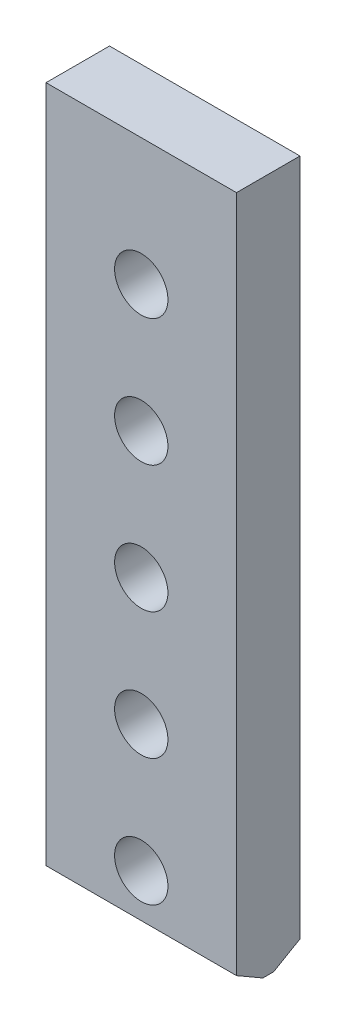
ISO-10303-21;
HEADER;
FILE_DESCRIPTION(('STEP AP214'),'2;1');
FILE_NAME('part.step','',(''),(''),'','','');
FILE_SCHEMA(('AUTOMOTIVE_DESIGN { 1 0 10303 214 1 1 1 1 }'));
ENDSEC;
DATA;
#1=APPLICATION_CONTEXT('core data for automotive mechanical design processes');
#2=APPLICATION_PROTOCOL_DEFINITION('international standard','automotive_design',2000,#1);
#3=PRODUCT_CONTEXT('',#1,'mechanical');
#4=PRODUCT('Part','Part','',(#3));
#5=PRODUCT_RELATED_PRODUCT_CATEGORY('part','',(#4));
#6=PRODUCT_DEFINITION_FORMATION('','',#4);
#7=PRODUCT_DEFINITION_CONTEXT('part definition',#1,'design');
#8=PRODUCT_DEFINITION('design','',#6,#7);
#9=PRODUCT_DEFINITION_SHAPE('','',#8);
#10=(LENGTH_UNIT() NAMED_UNIT(*) SI_UNIT(.MILLI.,.METRE.));
#11=(NAMED_UNIT(*) PLANE_ANGLE_UNIT() SI_UNIT($,.RADIAN.));
#12=(NAMED_UNIT(*) SI_UNIT($,.STERADIAN.) SOLID_ANGLE_UNIT());
#13=UNCERTAINTY_MEASURE_WITH_UNIT(LENGTH_MEASURE(1.E-05),#10,'distance_accuracy_value','');
#14=(GEOMETRIC_REPRESENTATION_CONTEXT(3) GLOBAL_UNCERTAINTY_ASSIGNED_CONTEXT((#13)) GLOBAL_UNIT_ASSIGNED_CONTEXT((#10,
#11,#12)) REPRESENTATION_CONTEXT('',''));
#15=CARTESIAN_POINT('',(0.,0.,0.));
#16=DIRECTION('',(0.,0.,1.));
#17=DIRECTION('',(1.,0.,0.));
#18=AXIS2_PLACEMENT_3D('',#15,#16,#17);
#19=CARTESIAN_POINT('',(0.,0.,25.));
#20=DIRECTION('',(1.,0.,0.));
#21=DIRECTION('',(0.,1.,0.));
#22=AXIS2_PLACEMENT_3D('',#19,#20,#21);
#23=PLANE('',#22);
#24=DIRECTION('',(0.,0.,-1.));
#25=VECTOR('',#24,1.);
#26=CARTESIAN_POINT('',(0.,0.,25.));
#27=LINE('',#26,#25);
#28=CARTESIAN_POINT('',(0.,0.,14.6076951545868));
#29=VERTEX_POINT('',#28);
#30=CARTESIAN_POINT('',(0.,0.,10.3923048454132));
#31=VERTEX_POINT('',#30);
#32=EDGE_CURVE('E149',#29,#31,#27,.T.);
#33=ORIENTED_EDGE('',*,*,#32,.F.);
#34=DIRECTION('',(0.,-0.500000000000002,-0.866025403784438));
#35=VECTOR('',#34,1.);
#36=CARTESIAN_POINT('',(0.,6.00000000000001,25.));
#37=LINE('',#36,#35);
#38=CARTESIAN_POINT('',(0.,6.00000000000001,25.));
#39=VERTEX_POINT('',#38);
#40=EDGE_CURVE('E12',#29,#39,#37,.F.);
#41=ORIENTED_EDGE('',*,*,#40,.T.);
#42=DIRECTION('',(0.,-1.,0.));
#43=VECTOR('',#42,1.);
#44=CARTESIAN_POINT('',(0.,0.,25.));
#45=LINE('',#44,#43);
#46=CARTESIAN_POINT('',(0.,273.,25.));
#47=VERTEX_POINT('',#46);
#48=EDGE_CURVE('E122',#47,#39,#45,.T.);
#49=ORIENTED_EDGE('',*,*,#48,.F.);
#50=DIRECTION('',(0.,0.,-1.));
#51=VECTOR('',#50,1.);
#52=CARTESIAN_POINT('',(0.,273.,25.));
#53=LINE('',#52,#51);
#54=CARTESIAN_POINT('',(0.,273.,0.));
#55=VERTEX_POINT('',#54);
#56=EDGE_CURVE('E132',#47,#55,#53,.T.);
#57=ORIENTED_EDGE('',*,*,#56,.T.);
#58=DIRECTION('',(0.,-1.,0.));
#59=VECTOR('',#58,1.);
#60=CARTESIAN_POINT('',(0.,0.,0.));
#61=LINE('',#60,#59);
#62=CARTESIAN_POINT('',(0.,6.00000000000001,0.));
#63=VERTEX_POINT('',#62);
#64=EDGE_CURVE('E141',#55,#63,#61,.T.);
#65=ORIENTED_EDGE('',*,*,#64,.T.);
#66=DIRECTION('',(0.,-0.500000000000002,0.866025403784438));
#67=VECTOR('',#66,1.);
#68=CARTESIAN_POINT('',(0.,0.,10.3923048454132));
#69=LINE('',#68,#67);
#70=EDGE_CURVE('E158',#63,#31,#69,.T.);
#71=ORIENTED_EDGE('',*,*,#70,.T.);
#72=EDGE_LOOP('',(#33,#41,#49,#57,#65,#71));
#73=FACE_BOUND('',#72,.T.);
#74=ADVANCED_FACE('F63',(#73),#23,.F.);
#75=CARTESIAN_POINT('',(0.,0.,25.));
#76=DIRECTION('',(0.,1.,0.));
#77=DIRECTION('',(-1.,0.,0.));
#78=AXIS2_PLACEMENT_3D('',#75,#76,#77);
#79=PLANE('',#78);
#80=DIRECTION('',(0.,0.,-1.));
#81=VECTOR('',#80,1.);
#82=CARTESIAN_POINT('',(75.0000000000001,0.,25.));
#83=LINE('',#82,#81);
#84=CARTESIAN_POINT('',(75.0000000000001,0.,14.6076951545868));
#85=VERTEX_POINT('',#84);
#86=CARTESIAN_POINT('',(75.0000000000001,0.,10.3923048454132));
#87=VERTEX_POINT('',#86);
#88=EDGE_CURVE('E131',#85,#87,#83,.T.);
#89=ORIENTED_EDGE('',*,*,#88,.F.);
#90=DIRECTION('',(-1.,0.,0.));
#91=VECTOR('',#90,1.);
#92=CARTESIAN_POINT('',(0.,0.,14.6076951545868));
#93=LINE('',#92,#91);
#94=EDGE_CURVE('E71',#85,#29,#93,.T.);
#95=ORIENTED_EDGE('',*,*,#94,.T.);
#96=ORIENTED_EDGE('',*,*,#32,.T.);
#97=DIRECTION('',(1.,0.,0.));
#98=VECTOR('',#97,1.);
#99=CARTESIAN_POINT('',(75.0000000000001,0.,10.3923048454132));
#100=LINE('',#99,#98);
#101=EDGE_CURVE('E151',#31,#87,#100,.T.);
#102=ORIENTED_EDGE('',*,*,#101,.T.);
#103=EDGE_LOOP('',(#89,#95,#96,#102));
#104=FACE_BOUND('',#103,.T.);
#105=ADVANCED_FACE('F171',(#104),#79,.F.);
#106=CARTESIAN_POINT('',(75.0000000000001,0.,25.));
#107=DIRECTION('',(-1.,0.,0.));
#108=DIRECTION('',(0.,-1.,0.));
#109=AXIS2_PLACEMENT_3D('',#106,#107,#108);
#110=PLANE('',#109);
#111=DIRECTION('',(0.,1.,0.));
#112=VECTOR('',#111,1.);
#113=CARTESIAN_POINT('',(75.0000000000001,0.,25.));
#114=LINE('',#113,#112);
#115=CARTESIAN_POINT('',(75.0000000000001,6.00000000000002,25.));
#116=VERTEX_POINT('',#115);
#117=CARTESIAN_POINT('',(75.,273.,25.));
#118=VERTEX_POINT('',#117);
#119=EDGE_CURVE('E113',#116,#118,#114,.T.);
#120=ORIENTED_EDGE('',*,*,#119,.F.);
#121=DIRECTION('',(0.,0.500000000000002,0.866025403784438));
#122=VECTOR('',#121,1.);
#123=CARTESIAN_POINT('',(75.0000000000001,6.00000000000002,25.));
#124=LINE('',#123,#122);
#125=EDGE_CURVE('E85',#116,#85,#124,.F.);
#126=ORIENTED_EDGE('',*,*,#125,.T.);
#127=ORIENTED_EDGE('',*,*,#88,.T.);
#128=DIRECTION('',(0.,0.500000000000002,-0.866025403784438));
#129=VECTOR('',#128,1.);
#130=CARTESIAN_POINT('',(75.0000000000001,0.,10.3923048454132));
#131=LINE('',#130,#129);
#132=CARTESIAN_POINT('',(75.0000000000001,6.00000000000002,0.));
#133=VERTEX_POINT('',#132);
#134=EDGE_CURVE('E154',#87,#133,#131,.T.);
#135=ORIENTED_EDGE('',*,*,#134,.T.);
#136=DIRECTION('',(0.,1.,0.));
#137=VECTOR('',#136,1.);
#138=CARTESIAN_POINT('',(75.0000000000001,0.,0.));
#139=LINE('',#138,#137);
#140=CARTESIAN_POINT('',(75.,273.,0.));
#141=VERTEX_POINT('',#140);
#142=EDGE_CURVE('E128',#133,#141,#139,.T.);
#143=ORIENTED_EDGE('',*,*,#142,.T.);
#144=DIRECTION('',(0.,0.,-1.));
#145=VECTOR('',#144,1.);
#146=CARTESIAN_POINT('',(75.,273.,25.));
#147=LINE('',#146,#145);
#148=EDGE_CURVE('E125',#118,#141,#147,.T.);
#149=ORIENTED_EDGE('',*,*,#148,.F.);
#150=EDGE_LOOP('',(#120,#126,#127,#135,#143,#149));
#151=FACE_BOUND('',#150,.T.);
#152=ADVANCED_FACE('F126',(#151),#110,.F.);
#153=CARTESIAN_POINT('',(0.,273.,25.));
#154=DIRECTION('',(0.,-1.,0.));
#155=DIRECTION('',(0.,0.,-1.));
#156=AXIS2_PLACEMENT_3D('',#153,#154,#155);
#157=PLANE('',#156);
#158=DIRECTION('',(-1.,0.,0.));
#159=VECTOR('',#158,1.);
#160=CARTESIAN_POINT('',(0.,273.,0.));
#161=LINE('',#160,#159);
#162=EDGE_CURVE('E146',#141,#55,#161,.T.);
#163=ORIENTED_EDGE('',*,*,#162,.T.);
#164=ORIENTED_EDGE('',*,*,#56,.F.);
#165=DIRECTION('',(-1.,0.,0.));
#166=VECTOR('',#165,1.);
#167=CARTESIAN_POINT('',(0.,273.,25.));
#168=LINE('',#167,#166);
#169=EDGE_CURVE('E118',#118,#47,#168,.T.);
#170=ORIENTED_EDGE('',*,*,#169,.F.);
#171=ORIENTED_EDGE('',*,*,#148,.T.);
#172=EDGE_LOOP('',(#163,#164,#170,#171));
#173=FACE_BOUND('',#172,.T.);
#174=ADVANCED_FACE('F134',(#173),#157,.F.);
#175=CARTESIAN_POINT('',(0.,0.,25.));
#176=DIRECTION('',(0.,0.,-1.));
#177=DIRECTION('',(-1.,0.,0.));
#178=AXIS2_PLACEMENT_3D('',#175,#176,#177);
#179=PLANE('',#178);
#180=CARTESIAN_POINT('',(37.5000000000001,73.,25.));
#181=DIRECTION('',(0.,0.,1.));
#182=DIRECTION('',(1.,0.,0.));
#183=AXIS2_PLACEMENT_3D('',#180,#181,#182);
#184=CIRCLE('',#183,10.5);
#185=CARTESIAN_POINT('',(48.0000000000001,73.,25.));
#186=VERTEX_POINT('',#185);
#187=EDGE_CURVE('E198',#186,#186,#184,.T.);
#188=ORIENTED_EDGE('',*,*,#187,.F.);
#189=EDGE_LOOP('',(#188));
#190=FACE_BOUND('',#189,.T.);
#191=CARTESIAN_POINT('',(37.5000000000001,123.,25.));
#192=DIRECTION('',(0.,0.,1.));
#193=DIRECTION('',(1.,0.,0.));
#194=AXIS2_PLACEMENT_3D('',#191,#192,#193);
#195=CIRCLE('',#194,10.5);
#196=CARTESIAN_POINT('',(48.0000000000001,123.,25.));
#197=VERTEX_POINT('',#196);
#198=EDGE_CURVE('E192',#197,#197,#195,.T.);
#199=ORIENTED_EDGE('',*,*,#198,.F.);
#200=EDGE_LOOP('',(#199));
#201=FACE_BOUND('',#200,.T.);
#202=CARTESIAN_POINT('',(37.5000000000001,173.,25.));
#203=DIRECTION('',(0.,0.,1.));
#204=DIRECTION('',(1.,0.,0.));
#205=AXIS2_PLACEMENT_3D('',#202,#203,#204);
#206=CIRCLE('',#205,10.5);
#207=CARTESIAN_POINT('',(48.0000000000001,173.,25.));
#208=VERTEX_POINT('',#207);
#209=EDGE_CURVE('E186',#208,#208,#206,.T.);
#210=ORIENTED_EDGE('',*,*,#209,.F.);
#211=EDGE_LOOP('',(#210));
#212=FACE_BOUND('',#211,.T.);
#213=CARTESIAN_POINT('',(37.5000000000001,223.,25.));
#214=DIRECTION('',(0.,0.,1.));
#215=DIRECTION('',(1.,0.,0.));
#216=AXIS2_PLACEMENT_3D('',#213,#214,#215);
#217=CIRCLE('',#216,10.5);
#218=CARTESIAN_POINT('',(48.0000000000001,223.,25.));
#219=VERTEX_POINT('',#218);
#220=EDGE_CURVE('E180',#219,#219,#217,.T.);
#221=ORIENTED_EDGE('',*,*,#220,.F.);
#222=EDGE_LOOP('',(#221));
#223=FACE_BOUND('',#222,.T.);
#224=CARTESIAN_POINT('',(37.5000000000001,23.,25.));
#225=DIRECTION('',(0.,0.,1.));
#226=DIRECTION('',(1.,0.,0.));
#227=AXIS2_PLACEMENT_3D('',#224,#225,#226);
#228=CIRCLE('',#227,10.5);
#229=CARTESIAN_POINT('',(48.0000000000001,23.,25.));
#230=VERTEX_POINT('',#229);
#231=EDGE_CURVE('E174',#230,#230,#228,.T.);
#232=ORIENTED_EDGE('',*,*,#231,.F.);
#233=EDGE_LOOP('',(#232));
#234=FACE_BOUND('',#233,.T.);
#235=ORIENTED_EDGE('',*,*,#48,.T.);
#236=DIRECTION('',(1.,0.,0.));
#237=VECTOR('',#236,1.);
#238=CARTESIAN_POINT('',(0.,6.00000000000001,25.));
#239=LINE('',#238,#237);
#240=EDGE_CURVE('E121',#39,#116,#239,.T.);
#241=ORIENTED_EDGE('',*,*,#240,.T.);
#242=ORIENTED_EDGE('',*,*,#119,.T.);
#243=ORIENTED_EDGE('',*,*,#169,.T.);
#244=EDGE_LOOP('',(#235,#241,#242,#243));
#245=FACE_BOUND('',#244,.T.);
#246=ADVANCED_FACE('F116',(#190,#201,#212,#223,#234,#245),#179,.F.);
#247=CARTESIAN_POINT('',(0.,0.,0.));
#248=DIRECTION('',(0.,0.,-1.));
#249=DIRECTION('',(-1.,0.,0.));
#250=AXIS2_PLACEMENT_3D('',#247,#248,#249);
#251=PLANE('',#250);
#252=CARTESIAN_POINT('',(37.5000000000001,73.,0.));
#253=DIRECTION('',(0.,0.,1.));
#254=DIRECTION('',(1.,0.,0.));
#255=AXIS2_PLACEMENT_3D('',#252,#253,#254);
#256=CIRCLE('',#255,10.5);
#257=CARTESIAN_POINT('',(48.0000000000001,73.,0.));
#258=VERTEX_POINT('',#257);
#259=EDGE_CURVE('E177',#258,#258,#256,.T.);
#260=ORIENTED_EDGE('',*,*,#259,.T.);
#261=EDGE_LOOP('',(#260));
#262=FACE_BOUND('',#261,.T.);
#263=CARTESIAN_POINT('',(37.5000000000001,123.,0.));
#264=DIRECTION('',(0.,0.,1.));
#265=DIRECTION('',(1.,0.,0.));
#266=AXIS2_PLACEMENT_3D('',#263,#264,#265);
#267=CIRCLE('',#266,10.5);
#268=CARTESIAN_POINT('',(48.0000000000001,123.,0.));
#269=VERTEX_POINT('',#268);
#270=EDGE_CURVE('E195',#269,#269,#267,.T.);
#271=ORIENTED_EDGE('',*,*,#270,.T.);
#272=EDGE_LOOP('',(#271));
#273=FACE_BOUND('',#272,.T.);
#274=CARTESIAN_POINT('',(37.5000000000001,173.,0.));
#275=DIRECTION('',(0.,0.,1.));
#276=DIRECTION('',(1.,0.,0.));
#277=AXIS2_PLACEMENT_3D('',#274,#275,#276);
#278=CIRCLE('',#277,10.5);
#279=CARTESIAN_POINT('',(48.0000000000001,173.,0.));
#280=VERTEX_POINT('',#279);
#281=EDGE_CURVE('E189',#280,#280,#278,.T.);
#282=ORIENTED_EDGE('',*,*,#281,.T.);
#283=EDGE_LOOP('',(#282));
#284=FACE_BOUND('',#283,.T.);
#285=CARTESIAN_POINT('',(37.5000000000001,223.,0.));
#286=DIRECTION('',(0.,0.,1.));
#287=DIRECTION('',(1.,0.,0.));
#288=AXIS2_PLACEMENT_3D('',#285,#286,#287);
#289=CIRCLE('',#288,10.5);
#290=CARTESIAN_POINT('',(48.0000000000001,223.,0.));
#291=VERTEX_POINT('',#290);
#292=EDGE_CURVE('E183',#291,#291,#289,.T.);
#293=ORIENTED_EDGE('',*,*,#292,.T.);
#294=EDGE_LOOP('',(#293));
#295=FACE_BOUND('',#294,.T.);
#296=CARTESIAN_POINT('',(37.5000000000001,23.,0.));
#297=DIRECTION('',(0.,0.,1.));
#298=DIRECTION('',(1.,0.,0.));
#299=AXIS2_PLACEMENT_3D('',#296,#297,#298);
#300=CIRCLE('',#299,10.5);
#301=CARTESIAN_POINT('',(48.0000000000001,23.,0.));
#302=VERTEX_POINT('',#301);
#303=EDGE_CURVE('E144',#302,#302,#300,.T.);
#304=ORIENTED_EDGE('',*,*,#303,.T.);
#305=EDGE_LOOP('',(#304));
#306=FACE_BOUND('',#305,.T.);
#307=ORIENTED_EDGE('',*,*,#142,.F.);
#308=DIRECTION('',(-1.,0.,0.));
#309=VECTOR('',#308,1.);
#310=CARTESIAN_POINT('',(0.,6.00000000000001,0.));
#311=LINE('',#310,#309);
#312=EDGE_CURVE('E156',#133,#63,#311,.T.);
#313=ORIENTED_EDGE('',*,*,#312,.T.);
#314=ORIENTED_EDGE('',*,*,#64,.F.);
#315=ORIENTED_EDGE('',*,*,#162,.F.);
#316=EDGE_LOOP('',(#307,#313,#314,#315));
#317=FACE_BOUND('',#316,.T.);
#318=ADVANCED_FACE('F204',(#262,#273,#284,#295,#306,#317),#251,.T.);
#319=CARTESIAN_POINT('',(37.5000000000001,23.,0.));
#320=DIRECTION('',(0.,0.,1.));
#321=DIRECTION('',(1.,0.,0.));
#322=AXIS2_PLACEMENT_3D('',#319,#320,#321);
#323=CYLINDRICAL_SURFACE('',#322,10.5);
#324=ORIENTED_EDGE('',*,*,#303,.F.);
#325=EDGE_LOOP('',(#324));
#326=FACE_BOUND('',#325,.T.);
#327=ORIENTED_EDGE('',*,*,#231,.T.);
#328=EDGE_LOOP('',(#327));
#329=FACE_BOUND('',#328,.T.);
#330=ADVANCED_FACE('F225',(#326,#329),#323,.F.);
#331=CARTESIAN_POINT('',(37.5000000000001,223.,0.));
#332=DIRECTION('',(0.,0.,1.));
#333=DIRECTION('',(1.,0.,0.));
#334=AXIS2_PLACEMENT_3D('',#331,#332,#333);
#335=CYLINDRICAL_SURFACE('',#334,10.5);
#336=ORIENTED_EDGE('',*,*,#292,.F.);
#337=EDGE_LOOP('',(#336));
#338=FACE_BOUND('',#337,.T.);
#339=ORIENTED_EDGE('',*,*,#220,.T.);
#340=EDGE_LOOP('',(#339));
#341=FACE_BOUND('',#340,.T.);
#342=ADVANCED_FACE('F227',(#338,#341),#335,.F.);
#343=CARTESIAN_POINT('',(37.5000000000001,173.,0.));
#344=DIRECTION('',(0.,0.,1.));
#345=DIRECTION('',(1.,0.,0.));
#346=AXIS2_PLACEMENT_3D('',#343,#344,#345);
#347=CYLINDRICAL_SURFACE('',#346,10.5);
#348=ORIENTED_EDGE('',*,*,#281,.F.);
#349=EDGE_LOOP('',(#348));
#350=FACE_BOUND('',#349,.T.);
#351=ORIENTED_EDGE('',*,*,#209,.T.);
#352=EDGE_LOOP('',(#351));
#353=FACE_BOUND('',#352,.T.);
#354=ADVANCED_FACE('F234',(#350,#353),#347,.F.);
#355=CARTESIAN_POINT('',(37.5000000000001,123.,0.));
#356=DIRECTION('',(0.,0.,1.));
#357=DIRECTION('',(1.,0.,0.));
#358=AXIS2_PLACEMENT_3D('',#355,#356,#357);
#359=CYLINDRICAL_SURFACE('',#358,10.5);
#360=ORIENTED_EDGE('',*,*,#270,.F.);
#361=EDGE_LOOP('',(#360));
#362=FACE_BOUND('',#361,.T.);
#363=ORIENTED_EDGE('',*,*,#198,.T.);
#364=EDGE_LOOP('',(#363));
#365=FACE_BOUND('',#364,.T.);
#366=ADVANCED_FACE('F210',(#362,#365),#359,.F.);
#367=CARTESIAN_POINT('',(37.5000000000001,73.,0.));
#368=DIRECTION('',(0.,0.,1.));
#369=DIRECTION('',(1.,0.,0.));
#370=AXIS2_PLACEMENT_3D('',#367,#368,#369);
#371=CYLINDRICAL_SURFACE('',#370,10.5);
#372=ORIENTED_EDGE('',*,*,#259,.F.);
#373=EDGE_LOOP('',(#372));
#374=FACE_BOUND('',#373,.T.);
#375=ORIENTED_EDGE('',*,*,#187,.T.);
#376=EDGE_LOOP('',(#375));
#377=FACE_BOUND('',#376,.T.);
#378=ADVANCED_FACE('F207',(#374,#377),#371,.F.);
#379=CARTESIAN_POINT('',(0.,0.,10.3923048454132));
#380=DIRECTION('',(0.,-0.866025403784438,-0.500000000000002));
#381=DIRECTION('',(-1.,0.,0.));
#382=AXIS2_PLACEMENT_3D('',#379,#380,#381);
#383=PLANE('',#382);
#384=ORIENTED_EDGE('',*,*,#70,.F.);
#385=ORIENTED_EDGE('',*,*,#312,.F.);
#386=ORIENTED_EDGE('',*,*,#134,.F.);
#387=ORIENTED_EDGE('',*,*,#101,.F.);
#388=EDGE_LOOP('',(#384,#385,#386,#387));
#389=FACE_BOUND('',#388,.T.);
#390=ADVANCED_FACE('F170',(#389),#383,.T.);
#391=CARTESIAN_POINT('',(0.,6.00000000000001,25.));
#392=DIRECTION('',(0.,0.866025403784438,-0.500000000000002));
#393=DIRECTION('',(1.,0.,0.));
#394=AXIS2_PLACEMENT_3D('',#391,#392,#393);
#395=PLANE('',#394);
#396=ORIENTED_EDGE('',*,*,#40,.F.);
#397=ORIENTED_EDGE('',*,*,#94,.F.);
#398=ORIENTED_EDGE('',*,*,#125,.F.);
#399=ORIENTED_EDGE('',*,*,#240,.F.);
#400=EDGE_LOOP('',(#396,#397,#398,#399));
#401=FACE_BOUND('',#400,.T.);
#402=ADVANCED_FACE('F65',(#401),#395,.F.);
#403=CLOSED_SHELL('',(#74,#105,#152,#174,#246,#318,#330,#342,#354,#366,#378,#390,#402));
#404=MANIFOLD_SOLID_BREP('B2',#403);
#405=ADVANCED_BREP_SHAPE_REPRESENTATION('',(#18,#404),#14);
#406=SHAPE_DEFINITION_REPRESENTATION(#9,#405);
ENDSEC;
END-ISO-10303-21;
